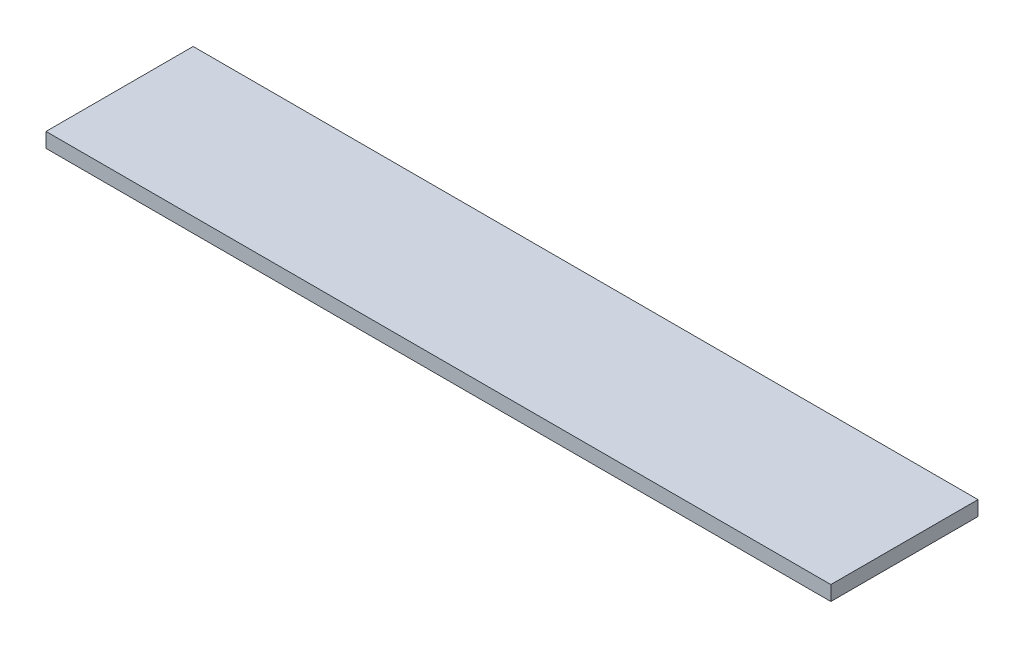
ISO-10303-21;
HEADER;
FILE_DESCRIPTION(('STEP AP214'),'2;1');
FILE_NAME('part.step','',(''),(''),'','','');
FILE_SCHEMA(('AUTOMOTIVE_DESIGN { 1 0 10303 214 1 1 1 1 }'));
ENDSEC;
DATA;
#1=APPLICATION_CONTEXT('core data for automotive mechanical design processes');
#2=APPLICATION_PROTOCOL_DEFINITION('international standard','automotive_design',2000,#1);
#3=PRODUCT_CONTEXT('',#1,'mechanical');
#4=PRODUCT('Part','Part','',(#3));
#5=PRODUCT_RELATED_PRODUCT_CATEGORY('part','',(#4));
#6=PRODUCT_DEFINITION_FORMATION('','',#4);
#7=PRODUCT_DEFINITION_CONTEXT('part definition',#1,'design');
#8=PRODUCT_DEFINITION('design','',#6,#7);
#9=PRODUCT_DEFINITION_SHAPE('','',#8);
#10=(LENGTH_UNIT() NAMED_UNIT(*) SI_UNIT(.MILLI.,.METRE.));
#11=(NAMED_UNIT(*) PLANE_ANGLE_UNIT() SI_UNIT($,.RADIAN.));
#12=(NAMED_UNIT(*) SI_UNIT($,.STERADIAN.) SOLID_ANGLE_UNIT());
#13=UNCERTAINTY_MEASURE_WITH_UNIT(LENGTH_MEASURE(1.E-05),#10,'distance_accuracy_value','');
#14=(GEOMETRIC_REPRESENTATION_CONTEXT(3) GLOBAL_UNCERTAINTY_ASSIGNED_CONTEXT((#13)) GLOBAL_UNIT_ASSIGNED_CONTEXT((#10,
#11,#12)) REPRESENTATION_CONTEXT('',''));
#15=CARTESIAN_POINT('',(0.,0.,0.));
#16=DIRECTION('',(0.,0.,1.));
#17=DIRECTION('',(1.,0.,0.));
#18=AXIS2_PLACEMENT_3D('',#15,#16,#17);
#19=CARTESIAN_POINT('',(0.,0.1905,0.));
#20=DIRECTION('',(1.,0.,0.));
#21=DIRECTION('',(0.,0.,-1.));
#22=AXIS2_PLACEMENT_3D('',#19,#20,#21);
#23=PLANE('',#22);
#24=DIRECTION('',(0.,0.,1.));
#25=VECTOR('',#24,1.);
#26=CARTESIAN_POINT('',(0.,0.,0.));
#27=LINE('',#26,#25);
#28=CARTESIAN_POINT('',(0.,0.,-1.905));
#29=VERTEX_POINT('',#28);
#30=CARTESIAN_POINT('',(0.,0.,0.));
#31=VERTEX_POINT('',#30);
#32=EDGE_CURVE('E107',#29,#31,#27,.T.);
#33=ORIENTED_EDGE('',*,*,#32,.T.);
#34=DIRECTION('',(0.,-1.,0.));
#35=VECTOR('',#34,1.);
#36=CARTESIAN_POINT('',(0.,0.1905,0.));
#37=LINE('',#36,#35);
#38=CARTESIAN_POINT('',(0.,0.1905,0.));
#39=VERTEX_POINT('',#38);
#40=EDGE_CURVE('E11',#39,#31,#37,.T.);
#41=ORIENTED_EDGE('',*,*,#40,.F.);
#42=DIRECTION('',(0.,0.,1.));
#43=VECTOR('',#42,1.);
#44=CARTESIAN_POINT('',(0.,0.1905,0.));
#45=LINE('',#44,#43);
#46=CARTESIAN_POINT('',(0.,0.1905,-1.905));
#47=VERTEX_POINT('',#46);
#48=EDGE_CURVE('E91',#47,#39,#45,.T.);
#49=ORIENTED_EDGE('',*,*,#48,.F.);
#50=DIRECTION('',(0.,-1.,0.));
#51=VECTOR('',#50,1.);
#52=CARTESIAN_POINT('',(0.,0.1905,-1.905));
#53=LINE('',#52,#51);
#54=EDGE_CURVE('E103',#47,#29,#53,.T.);
#55=ORIENTED_EDGE('',*,*,#54,.T.);
#56=EDGE_LOOP('',(#33,#41,#49,#55));
#57=FACE_BOUND('',#56,.T.);
#58=ADVANCED_FACE('F39',(#57),#23,.F.);
#59=CARTESIAN_POINT('',(0.,0.1905,0.));
#60=DIRECTION('',(0.,0.,-1.));
#61=DIRECTION('',(-1.,0.,0.));
#62=AXIS2_PLACEMENT_3D('',#59,#60,#61);
#63=PLANE('',#62);
#64=DIRECTION('',(1.,0.,0.));
#65=VECTOR('',#64,1.);
#66=CARTESIAN_POINT('',(0.,0.,0.));
#67=LINE('',#66,#65);
#68=CARTESIAN_POINT('',(10.16,0.,0.));
#69=VERTEX_POINT('',#68);
#70=EDGE_CURVE('E96',#31,#69,#67,.T.);
#71=ORIENTED_EDGE('',*,*,#70,.T.);
#72=DIRECTION('',(0.,-1.,0.));
#73=VECTOR('',#72,1.);
#74=CARTESIAN_POINT('',(10.16,0.1905,0.));
#75=LINE('',#74,#73);
#76=CARTESIAN_POINT('',(10.16,0.1905,0.));
#77=VERTEX_POINT('',#76);
#78=EDGE_CURVE('E48',#77,#69,#75,.T.);
#79=ORIENTED_EDGE('',*,*,#78,.F.);
#80=DIRECTION('',(1.,0.,0.));
#81=VECTOR('',#80,1.);
#82=CARTESIAN_POINT('',(0.,0.1905,0.));
#83=LINE('',#82,#81);
#84=EDGE_CURVE('E86',#39,#77,#83,.T.);
#85=ORIENTED_EDGE('',*,*,#84,.F.);
#86=ORIENTED_EDGE('',*,*,#40,.T.);
#87=EDGE_LOOP('',(#71,#79,#85,#86));
#88=FACE_BOUND('',#87,.T.);
#89=ADVANCED_FACE('F95',(#88),#63,.F.);
#90=CARTESIAN_POINT('',(10.16,0.1905,0.));
#91=DIRECTION('',(-1.,0.,0.));
#92=DIRECTION('',(0.,0.,1.));
#93=AXIS2_PLACEMENT_3D('',#90,#91,#92);
#94=PLANE('',#93);
#95=DIRECTION('',(0.,0.,-1.));
#96=VECTOR('',#95,1.);
#97=CARTESIAN_POINT('',(10.16,0.,0.));
#98=LINE('',#97,#96);
#99=CARTESIAN_POINT('',(10.16,0.,-1.905));
#100=VERTEX_POINT('',#99);
#101=EDGE_CURVE('E73',#69,#100,#98,.T.);
#102=ORIENTED_EDGE('',*,*,#101,.T.);
#103=DIRECTION('',(0.,-1.,0.));
#104=VECTOR('',#103,1.);
#105=CARTESIAN_POINT('',(10.16,0.1905,-1.905));
#106=LINE('',#105,#104);
#107=CARTESIAN_POINT('',(10.16,0.1905,-1.905));
#108=VERTEX_POINT('',#107);
#109=EDGE_CURVE('E98',#108,#100,#106,.T.);
#110=ORIENTED_EDGE('',*,*,#109,.F.);
#111=DIRECTION('',(0.,0.,-1.));
#112=VECTOR('',#111,1.);
#113=CARTESIAN_POINT('',(10.16,0.1905,0.));
#114=LINE('',#113,#112);
#115=EDGE_CURVE('E89',#77,#108,#114,.T.);
#116=ORIENTED_EDGE('',*,*,#115,.F.);
#117=ORIENTED_EDGE('',*,*,#78,.T.);
#118=EDGE_LOOP('',(#102,#110,#116,#117));
#119=FACE_BOUND('',#118,.T.);
#120=ADVANCED_FACE('F99',(#119),#94,.F.);
#121=CARTESIAN_POINT('',(0.,0.1905,-1.905));
#122=DIRECTION('',(0.,0.,1.));
#123=DIRECTION('',(1.,0.,0.));
#124=AXIS2_PLACEMENT_3D('',#121,#122,#123);
#125=PLANE('',#124);
#126=DIRECTION('',(-1.,0.,0.));
#127=VECTOR('',#126,1.);
#128=CARTESIAN_POINT('',(0.,0.,-1.905));
#129=LINE('',#128,#127);
#130=EDGE_CURVE('E79',#100,#29,#129,.T.);
#131=ORIENTED_EDGE('',*,*,#130,.T.);
#132=ORIENTED_EDGE('',*,*,#54,.F.);
#133=DIRECTION('',(-1.,0.,0.));
#134=VECTOR('',#133,1.);
#135=CARTESIAN_POINT('',(0.,0.1905,-1.905));
#136=LINE('',#135,#134);
#137=EDGE_CURVE('E56',#108,#47,#136,.T.);
#138=ORIENTED_EDGE('',*,*,#137,.F.);
#139=ORIENTED_EDGE('',*,*,#109,.T.);
#140=EDGE_LOOP('',(#131,#132,#138,#139));
#141=FACE_BOUND('',#140,.T.);
#142=ADVANCED_FACE('F120',(#141),#125,.F.);
#143=CARTESIAN_POINT('',(0.,0.1905,0.));
#144=DIRECTION('',(0.,-1.,0.));
#145=DIRECTION('',(0.,0.,-1.));
#146=AXIS2_PLACEMENT_3D('',#143,#144,#145);
#147=PLANE('',#146);
#148=ORIENTED_EDGE('',*,*,#48,.T.);
#149=ORIENTED_EDGE('',*,*,#84,.T.);
#150=ORIENTED_EDGE('',*,*,#115,.T.);
#151=ORIENTED_EDGE('',*,*,#137,.T.);
#152=EDGE_LOOP('',(#148,#149,#150,#151));
#153=FACE_BOUND('',#152,.T.);
#154=ADVANCED_FACE('F87',(#153),#147,.F.);
#155=CARTESIAN_POINT('',(0.,0.,0.));
#156=DIRECTION('',(0.,-1.,0.));
#157=DIRECTION('',(0.,0.,-1.));
#158=AXIS2_PLACEMENT_3D('',#155,#156,#157);
#159=PLANE('',#158);
#160=ORIENTED_EDGE('',*,*,#32,.F.);
#161=ORIENTED_EDGE('',*,*,#130,.F.);
#162=ORIENTED_EDGE('',*,*,#101,.F.);
#163=ORIENTED_EDGE('',*,*,#70,.F.);
#164=EDGE_LOOP('',(#160,#161,#162,#163));
#165=FACE_BOUND('',#164,.T.);
#166=ADVANCED_FACE('F123',(#165),#159,.T.);
#167=CLOSED_SHELL('',(#58,#89,#120,#142,#154,#166));
#168=MANIFOLD_SOLID_BREP('B2',#167);
#169=ADVANCED_BREP_SHAPE_REPRESENTATION('',(#18,#168),#14);
#170=SHAPE_DEFINITION_REPRESENTATION(#9,#169);
ENDSEC;
END-ISO-10303-21;
